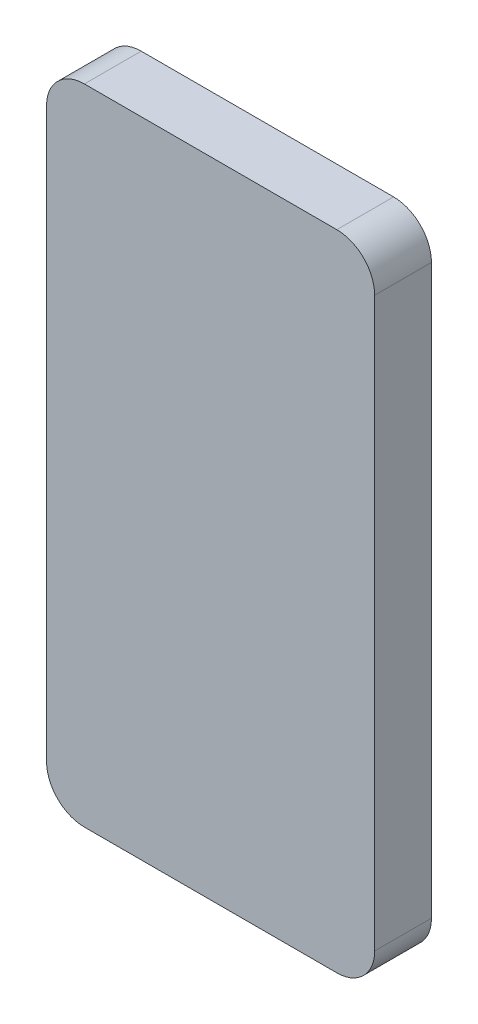
ISO-10303-21;
HEADER;
FILE_DESCRIPTION(('STEP AP214'),'2;1');
FILE_NAME('part.step','',(''),(''),'','','');
FILE_SCHEMA(('AUTOMOTIVE_DESIGN { 1 0 10303 214 1 1 1 1 }'));
ENDSEC;
DATA;
#1=APPLICATION_CONTEXT('core data for automotive mechanical design processes');
#2=APPLICATION_PROTOCOL_DEFINITION('international standard','automotive_design',2000,#1);
#3=PRODUCT_CONTEXT('',#1,'mechanical');
#4=PRODUCT('Part','Part','',(#3));
#5=PRODUCT_RELATED_PRODUCT_CATEGORY('part','',(#4));
#6=PRODUCT_DEFINITION_FORMATION('','',#4);
#7=PRODUCT_DEFINITION_CONTEXT('part definition',#1,'design');
#8=PRODUCT_DEFINITION('design','',#6,#7);
#9=PRODUCT_DEFINITION_SHAPE('','',#8);
#10=(LENGTH_UNIT() NAMED_UNIT(*) SI_UNIT(.MILLI.,.METRE.));
#11=(NAMED_UNIT(*) PLANE_ANGLE_UNIT() SI_UNIT($,.RADIAN.));
#12=(NAMED_UNIT(*) SI_UNIT($,.STERADIAN.) SOLID_ANGLE_UNIT());
#13=UNCERTAINTY_MEASURE_WITH_UNIT(LENGTH_MEASURE(1.E-05),#10,'distance_accuracy_value','');
#14=(GEOMETRIC_REPRESENTATION_CONTEXT(3) GLOBAL_UNCERTAINTY_ASSIGNED_CONTEXT((#13)) GLOBAL_UNIT_ASSIGNED_CONTEXT((#10,
#11,#12)) REPRESENTATION_CONTEXT('',''));
#15=CARTESIAN_POINT('',(0.,0.,0.));
#16=DIRECTION('',(0.,0.,1.));
#17=DIRECTION('',(1.,0.,0.));
#18=AXIS2_PLACEMENT_3D('',#15,#16,#17);
#19=CARTESIAN_POINT('',(33.02,64.77,11.43));
#20=DIRECTION('',(-1.,0.,0.));
#21=DIRECTION('',(0.,-1.,0.));
#22=AXIS2_PLACEMENT_3D('',#19,#20,#21);
#23=PLANE('',#22);
#24=DIRECTION('',(0.,1.,0.));
#25=VECTOR('',#24,1.);
#26=CARTESIAN_POINT('',(33.02,64.77,11.43));
#27=LINE('',#26,#25);
#28=CARTESIAN_POINT('',(33.02,-57.15,11.43));
#29=VERTEX_POINT('',#28);
#30=CARTESIAN_POINT('',(33.02,57.15,11.43));
#31=VERTEX_POINT('',#30);
#32=EDGE_CURVE('E124',#29,#31,#27,.T.);
#33=ORIENTED_EDGE('',*,*,#32,.F.);
#34=DIRECTION('',(0.,0.,-1.));
#35=VECTOR('',#34,1.);
#36=CARTESIAN_POINT('',(33.02,-57.15,11.43));
#37=LINE('',#36,#35);
#38=CARTESIAN_POINT('',(33.02,-57.15,0.));
#39=VERTEX_POINT('',#38);
#40=EDGE_CURVE('E150',#29,#39,#37,.T.);
#41=ORIENTED_EDGE('',*,*,#40,.T.);
#42=DIRECTION('',(0.,1.,0.));
#43=VECTOR('',#42,1.);
#44=CARTESIAN_POINT('',(33.02,64.77,0.));
#45=LINE('',#44,#43);
#46=CARTESIAN_POINT('',(33.02,57.15,0.));
#47=VERTEX_POINT('',#46);
#48=EDGE_CURVE('E158',#39,#47,#45,.T.);
#49=ORIENTED_EDGE('',*,*,#48,.T.);
#50=DIRECTION('',(0.,0.,-1.));
#51=VECTOR('',#50,1.);
#52=CARTESIAN_POINT('',(33.02,57.15,11.43));
#53=LINE('',#52,#51);
#54=EDGE_CURVE('E148',#47,#31,#53,.F.);
#55=ORIENTED_EDGE('',*,*,#54,.T.);
#56=EDGE_LOOP('',(#33,#41,#49,#55));
#57=FACE_BOUND('',#56,.T.);
#58=ADVANCED_FACE('F33',(#57),#23,.F.);
#59=CARTESIAN_POINT('',(-33.02,64.77,11.43));
#60=DIRECTION('',(0.,-1.,0.));
#61=DIRECTION('',(0.,0.,-1.));
#62=AXIS2_PLACEMENT_3D('',#59,#60,#61);
#63=PLANE('',#62);
#64=DIRECTION('',(-1.,0.,0.));
#65=VECTOR('',#64,1.);
#66=CARTESIAN_POINT('',(-33.02,64.77,0.));
#67=LINE('',#66,#65);
#68=CARTESIAN_POINT('',(25.4,64.77,0.));
#69=VERTEX_POINT('',#68);
#70=CARTESIAN_POINT('',(-25.4,64.77,0.));
#71=VERTEX_POINT('',#70);
#72=EDGE_CURVE('E129',#69,#71,#67,.T.);
#73=ORIENTED_EDGE('',*,*,#72,.T.);
#74=DIRECTION('',(0.,0.,-1.));
#75=VECTOR('',#74,1.);
#76=CARTESIAN_POINT('',(-25.4,64.77,11.43));
#77=LINE('',#76,#75);
#78=CARTESIAN_POINT('',(-25.4,64.77,11.43));
#79=VERTEX_POINT('',#78);
#80=EDGE_CURVE('E11',#71,#79,#77,.F.);
#81=ORIENTED_EDGE('',*,*,#80,.T.);
#82=DIRECTION('',(-1.,0.,0.));
#83=VECTOR('',#82,1.);
#84=CARTESIAN_POINT('',(-33.02,64.77,11.43));
#85=LINE('',#84,#83);
#86=CARTESIAN_POINT('',(25.4,64.77,11.43));
#87=VERTEX_POINT('',#86);
#88=EDGE_CURVE('E127',#87,#79,#85,.T.);
#89=ORIENTED_EDGE('',*,*,#88,.F.);
#90=DIRECTION('',(0.,0.,-1.));
#91=VECTOR('',#90,1.);
#92=CARTESIAN_POINT('',(25.4,64.77,11.43));
#93=LINE('',#92,#91);
#94=EDGE_CURVE('E41',#87,#69,#93,.T.);
#95=ORIENTED_EDGE('',*,*,#94,.T.);
#96=EDGE_LOOP('',(#73,#81,#89,#95));
#97=FACE_BOUND('',#96,.T.);
#98=ADVANCED_FACE('F155',(#97),#63,.F.);
#99=CARTESIAN_POINT('',(-33.02,64.77,11.43));
#100=DIRECTION('',(1.,0.,0.));
#101=DIRECTION('',(0.,1.,0.));
#102=AXIS2_PLACEMENT_3D('',#99,#100,#101);
#103=PLANE('',#102);
#104=DIRECTION('',(0.,-1.,0.));
#105=VECTOR('',#104,1.);
#106=CARTESIAN_POINT('',(-33.02,64.77,0.));
#107=LINE('',#106,#105);
#108=CARTESIAN_POINT('',(-33.02,57.15,0.));
#109=VERTEX_POINT('',#108);
#110=CARTESIAN_POINT('',(-33.02,-57.15,0.));
#111=VERTEX_POINT('',#110);
#112=EDGE_CURVE('E125',#109,#111,#107,.T.);
#113=ORIENTED_EDGE('',*,*,#112,.T.);
#114=DIRECTION('',(0.,0.,-1.));
#115=VECTOR('',#114,1.);
#116=CARTESIAN_POINT('',(-33.02,-57.15,11.43));
#117=LINE('',#116,#115);
#118=CARTESIAN_POINT('',(-33.02,-57.15,11.43));
#119=VERTEX_POINT('',#118);
#120=EDGE_CURVE('E103',#111,#119,#117,.F.);
#121=ORIENTED_EDGE('',*,*,#120,.T.);
#122=DIRECTION('',(0.,-1.,0.));
#123=VECTOR('',#122,1.);
#124=CARTESIAN_POINT('',(-33.02,64.77,11.43));
#125=LINE('',#124,#123);
#126=CARTESIAN_POINT('',(-33.02,57.15,11.43));
#127=VERTEX_POINT('',#126);
#128=EDGE_CURVE('E162',#127,#119,#125,.T.);
#129=ORIENTED_EDGE('',*,*,#128,.F.);
#130=DIRECTION('',(0.,0.,-1.));
#131=VECTOR('',#130,1.);
#132=CARTESIAN_POINT('',(-33.02,57.15,11.43));
#133=LINE('',#132,#131);
#134=EDGE_CURVE('E108',#127,#109,#133,.T.);
#135=ORIENTED_EDGE('',*,*,#134,.T.);
#136=EDGE_LOOP('',(#113,#121,#129,#135));
#137=FACE_BOUND('',#136,.T.);
#138=ADVANCED_FACE('F172',(#137),#103,.F.);
#139=CARTESIAN_POINT('',(-33.02,-64.77,11.43));
#140=DIRECTION('',(0.,1.,0.));
#141=DIRECTION('',(0.,0.,1.));
#142=AXIS2_PLACEMENT_3D('',#139,#140,#141);
#143=PLANE('',#142);
#144=DIRECTION('',(1.,0.,0.));
#145=VECTOR('',#144,1.);
#146=CARTESIAN_POINT('',(-33.02,-64.77,11.43));
#147=LINE('',#146,#145);
#148=CARTESIAN_POINT('',(-25.4,-64.77,11.43));
#149=VERTEX_POINT('',#148);
#150=CARTESIAN_POINT('',(25.4,-64.77,11.43));
#151=VERTEX_POINT('',#150);
#152=EDGE_CURVE('E118',#149,#151,#147,.T.);
#153=ORIENTED_EDGE('',*,*,#152,.F.);
#154=DIRECTION('',(0.,0.,-1.));
#155=VECTOR('',#154,1.);
#156=CARTESIAN_POINT('',(-25.4,-64.77,11.43));
#157=LINE('',#156,#155);
#158=CARTESIAN_POINT('',(-25.4,-64.77,0.));
#159=VERTEX_POINT('',#158);
#160=EDGE_CURVE('E102',#149,#159,#157,.T.);
#161=ORIENTED_EDGE('',*,*,#160,.T.);
#162=DIRECTION('',(1.,0.,0.));
#163=VECTOR('',#162,1.);
#164=CARTESIAN_POINT('',(-33.02,-64.77,0.));
#165=LINE('',#164,#163);
#166=CARTESIAN_POINT('',(25.4,-64.77,0.));
#167=VERTEX_POINT('',#166);
#168=EDGE_CURVE('E115',#159,#167,#165,.T.);
#169=ORIENTED_EDGE('',*,*,#168,.T.);
#170=DIRECTION('',(0.,0.,-1.));
#171=VECTOR('',#170,1.);
#172=CARTESIAN_POINT('',(25.4,-64.77,11.43));
#173=LINE('',#172,#171);
#174=EDGE_CURVE('E120',#167,#151,#173,.F.);
#175=ORIENTED_EDGE('',*,*,#174,.T.);
#176=EDGE_LOOP('',(#153,#161,#169,#175));
#177=FACE_BOUND('',#176,.T.);
#178=ADVANCED_FACE('F114',(#177),#143,.F.);
#179=CARTESIAN_POINT('',(0.,0.,11.43));
#180=DIRECTION('',(0.,0.,1.));
#181=DIRECTION('',(1.,0.,0.));
#182=AXIS2_PLACEMENT_3D('',#179,#180,#181);
#183=PLANE('',#182);
#184=ORIENTED_EDGE('',*,*,#128,.T.);
#185=CARTESIAN_POINT('',(-25.4,-57.15,11.43));
#186=DIRECTION('',(0.,0.,1.));
#187=DIRECTION('',(1.,0.,0.));
#188=AXIS2_PLACEMENT_3D('',#185,#186,#187);
#189=CIRCLE('',#188,7.62);
#190=EDGE_CURVE('E146',#119,#149,#189,.T.);
#191=ORIENTED_EDGE('',*,*,#190,.T.);
#192=ORIENTED_EDGE('',*,*,#152,.T.);
#193=CARTESIAN_POINT('',(25.4,-57.15,11.43));
#194=DIRECTION('',(0.,0.,1.));
#195=DIRECTION('',(1.,0.,0.));
#196=AXIS2_PLACEMENT_3D('',#193,#194,#195);
#197=CIRCLE('',#196,7.62);
#198=EDGE_CURVE('E144',#151,#29,#197,.T.);
#199=ORIENTED_EDGE('',*,*,#198,.T.);
#200=ORIENTED_EDGE('',*,*,#32,.T.);
#201=CARTESIAN_POINT('',(25.4,57.15,11.43));
#202=DIRECTION('',(0.,0.,1.));
#203=DIRECTION('',(1.,0.,0.));
#204=AXIS2_PLACEMENT_3D('',#201,#202,#203);
#205=CIRCLE('',#204,7.62);
#206=EDGE_CURVE('E53',#31,#87,#205,.T.);
#207=ORIENTED_EDGE('',*,*,#206,.T.);
#208=ORIENTED_EDGE('',*,*,#88,.T.);
#209=CARTESIAN_POINT('',(-25.4,57.15,11.43));
#210=DIRECTION('',(0.,0.,1.));
#211=DIRECTION('',(1.,0.,0.));
#212=AXIS2_PLACEMENT_3D('',#209,#210,#211);
#213=CIRCLE('',#212,7.62);
#214=EDGE_CURVE('E142',#79,#127,#213,.T.);
#215=ORIENTED_EDGE('',*,*,#214,.T.);
#216=EDGE_LOOP('',(#184,#191,#192,#199,#200,#207,#208,#215));
#217=FACE_BOUND('',#216,.T.);
#218=ADVANCED_FACE('F166',(#217),#183,.T.);
#219=CARTESIAN_POINT('',(0.,0.,0.));
#220=DIRECTION('',(0.,0.,1.));
#221=DIRECTION('',(1.,0.,0.));
#222=AXIS2_PLACEMENT_3D('',#219,#220,#221);
#223=PLANE('',#222);
#224=ORIENTED_EDGE('',*,*,#168,.F.);
#225=CARTESIAN_POINT('',(-25.4,-57.15,0.));
#226=DIRECTION('',(0.,0.,1.));
#227=DIRECTION('',(1.,0.,0.));
#228=AXIS2_PLACEMENT_3D('',#225,#226,#227);
#229=CIRCLE('',#228,7.62);
#230=EDGE_CURVE('E98',#159,#111,#229,.F.);
#231=ORIENTED_EDGE('',*,*,#230,.T.);
#232=ORIENTED_EDGE('',*,*,#112,.F.);
#233=CARTESIAN_POINT('',(-25.4,57.15,0.));
#234=DIRECTION('',(0.,0.,1.));
#235=DIRECTION('',(1.,0.,0.));
#236=AXIS2_PLACEMENT_3D('',#233,#234,#235);
#237=CIRCLE('',#236,7.62);
#238=EDGE_CURVE('E135',#109,#71,#237,.F.);
#239=ORIENTED_EDGE('',*,*,#238,.T.);
#240=ORIENTED_EDGE('',*,*,#72,.F.);
#241=CARTESIAN_POINT('',(25.4,57.15,0.));
#242=DIRECTION('',(0.,0.,1.));
#243=DIRECTION('',(1.,0.,0.));
#244=AXIS2_PLACEMENT_3D('',#241,#242,#243);
#245=CIRCLE('',#244,7.62);
#246=EDGE_CURVE('E119',#69,#47,#245,.F.);
#247=ORIENTED_EDGE('',*,*,#246,.T.);
#248=ORIENTED_EDGE('',*,*,#48,.F.);
#249=CARTESIAN_POINT('',(25.4,-57.15,0.));
#250=DIRECTION('',(0.,0.,1.));
#251=DIRECTION('',(1.,0.,0.));
#252=AXIS2_PLACEMENT_3D('',#249,#250,#251);
#253=CIRCLE('',#252,7.62);
#254=EDGE_CURVE('E109',#39,#167,#253,.F.);
#255=ORIENTED_EDGE('',*,*,#254,.T.);
#256=EDGE_LOOP('',(#224,#231,#232,#239,#240,#247,#248,#255));
#257=FACE_BOUND('',#256,.T.);
#258=ADVANCED_FACE('F122',(#257),#223,.F.);
#259=CARTESIAN_POINT('',(-25.4,-57.15,11.43));
#260=DIRECTION('',(0.,0.,-1.));
#261=DIRECTION('',(-1.,0.,0.));
#262=AXIS2_PLACEMENT_3D('',#259,#260,#261);
#263=CYLINDRICAL_SURFACE('',#262,7.62);
#264=ORIENTED_EDGE('',*,*,#190,.F.);
#265=ORIENTED_EDGE('',*,*,#120,.F.);
#266=ORIENTED_EDGE('',*,*,#230,.F.);
#267=ORIENTED_EDGE('',*,*,#160,.F.);
#268=EDGE_LOOP('',(#264,#265,#266,#267));
#269=FACE_BOUND('',#268,.T.);
#270=ADVANCED_FACE('F101',(#269),#263,.T.);
#271=CARTESIAN_POINT('',(25.4,-57.15,11.43));
#272=DIRECTION('',(0.,0.,-1.));
#273=DIRECTION('',(-1.,0.,0.));
#274=AXIS2_PLACEMENT_3D('',#271,#272,#273);
#275=CYLINDRICAL_SURFACE('',#274,7.62);
#276=ORIENTED_EDGE('',*,*,#198,.F.);
#277=ORIENTED_EDGE('',*,*,#174,.F.);
#278=ORIENTED_EDGE('',*,*,#254,.F.);
#279=ORIENTED_EDGE('',*,*,#40,.F.);
#280=EDGE_LOOP('',(#276,#277,#278,#279));
#281=FACE_BOUND('',#280,.T.);
#282=ADVANCED_FACE('F177',(#281),#275,.T.);
#283=CARTESIAN_POINT('',(-25.4,57.15,11.43));
#284=DIRECTION('',(0.,0.,-1.));
#285=DIRECTION('',(-1.,0.,0.));
#286=AXIS2_PLACEMENT_3D('',#283,#284,#285);
#287=CYLINDRICAL_SURFACE('',#286,7.62);
#288=ORIENTED_EDGE('',*,*,#214,.F.);
#289=ORIENTED_EDGE('',*,*,#80,.F.);
#290=ORIENTED_EDGE('',*,*,#238,.F.);
#291=ORIENTED_EDGE('',*,*,#134,.F.);
#292=EDGE_LOOP('',(#288,#289,#290,#291));
#293=FACE_BOUND('',#292,.T.);
#294=ADVANCED_FACE('F170',(#293),#287,.T.);
#295=CARTESIAN_POINT('',(25.4,57.15,11.43));
#296=DIRECTION('',(0.,0.,-1.));
#297=DIRECTION('',(-1.,0.,0.));
#298=AXIS2_PLACEMENT_3D('',#295,#296,#297);
#299=CYLINDRICAL_SURFACE('',#298,7.62);
#300=ORIENTED_EDGE('',*,*,#206,.F.);
#301=ORIENTED_EDGE('',*,*,#54,.F.);
#302=ORIENTED_EDGE('',*,*,#246,.F.);
#303=ORIENTED_EDGE('',*,*,#94,.F.);
#304=EDGE_LOOP('',(#300,#301,#302,#303));
#305=FACE_BOUND('',#304,.T.);
#306=ADVANCED_FACE('F35',(#305),#299,.T.);
#307=CLOSED_SHELL('',(#58,#98,#138,#178,#218,#258,#270,#282,#294,#306));
#308=MANIFOLD_SOLID_BREP('B2',#307);
#309=ADVANCED_BREP_SHAPE_REPRESENTATION('',(#18,#308),#14);
#310=SHAPE_DEFINITION_REPRESENTATION(#9,#309);
ENDSEC;
END-ISO-10303-21;
